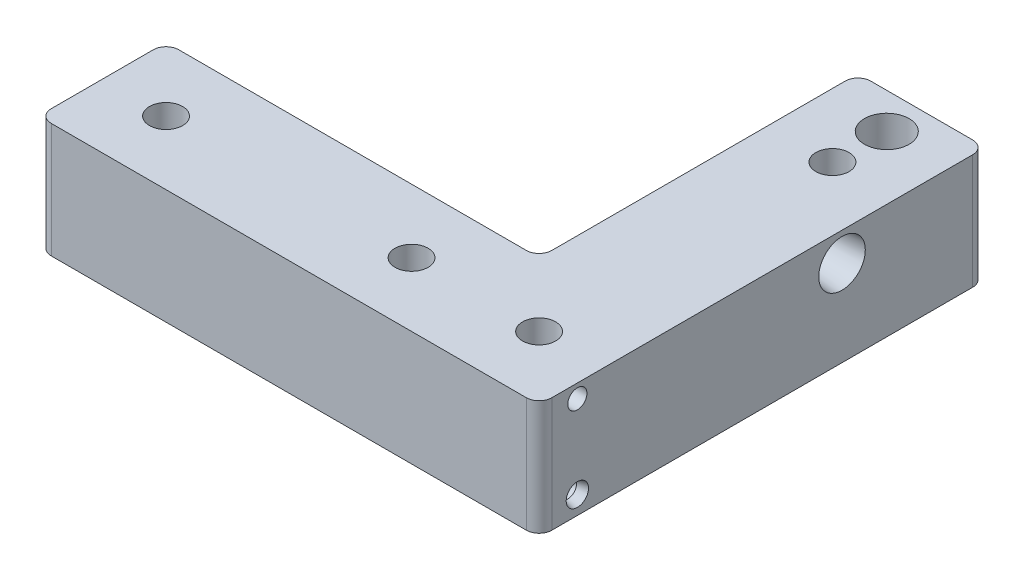
ISO-10303-21;
HEADER;
FILE_DESCRIPTION(('STEP AP214'),'2;1');
FILE_NAME('part.step','',(''),(''),'','','');
FILE_SCHEMA(('AUTOMOTIVE_DESIGN { 1 0 10303 214 1 1 1 1 }'));
ENDSEC;
DATA;
#1=APPLICATION_CONTEXT('core data for automotive mechanical design processes');
#2=APPLICATION_PROTOCOL_DEFINITION('international standard','automotive_design',2000,#1);
#3=PRODUCT_CONTEXT('',#1,'mechanical');
#4=PRODUCT('Part','Part','',(#3));
#5=PRODUCT_RELATED_PRODUCT_CATEGORY('part','',(#4));
#6=PRODUCT_DEFINITION_FORMATION('','',#4);
#7=PRODUCT_DEFINITION_CONTEXT('part definition',#1,'design');
#8=PRODUCT_DEFINITION('design','',#6,#7);
#9=PRODUCT_DEFINITION_SHAPE('','',#8);
#10=(LENGTH_UNIT() NAMED_UNIT(*) SI_UNIT(.MILLI.,.METRE.));
#11=(NAMED_UNIT(*) PLANE_ANGLE_UNIT() SI_UNIT($,.RADIAN.));
#12=(NAMED_UNIT(*) SI_UNIT($,.STERADIAN.) SOLID_ANGLE_UNIT());
#13=UNCERTAINTY_MEASURE_WITH_UNIT(LENGTH_MEASURE(1.E-05),#10,'distance_accuracy_value','');
#14=(GEOMETRIC_REPRESENTATION_CONTEXT(3) GLOBAL_UNCERTAINTY_ASSIGNED_CONTEXT((#13)) GLOBAL_UNIT_ASSIGNED_CONTEXT((#10,
#11,#12)) REPRESENTATION_CONTEXT('',''));
#15=CARTESIAN_POINT('',(0.,0.,0.));
#16=DIRECTION('',(0.,0.,1.));
#17=DIRECTION('',(1.,0.,0.));
#18=AXIS2_PLACEMENT_3D('',#15,#16,#17);
#19=CARTESIAN_POINT('',(150.,-5.14999999999999,-6.00000000000001));
#20=DIRECTION('',(1.,0.,0.));
#21=DIRECTION('',(0.,0.,-1.));
#22=AXIS2_PLACEMENT_3D('',#19,#20,#21);
#23=PLANE('',#22);
#24=CARTESIAN_POINT('',(150.,-5.14999999999999,-6.00000000000001));
#25=DIRECTION('',(1.,0.,0.));
#26=DIRECTION('',(0.,0.,-1.));
#27=AXIS2_PLACEMENT_3D('',#24,#25,#26);
#28=CIRCLE('',#27,1.35);
#29=CARTESIAN_POINT('',(150.,-5.14999999999999,-7.35));
#30=VERTEX_POINT('',#29);
#31=EDGE_CURVE('E19',#30,#30,#28,.T.);
#32=ORIENTED_EDGE('',*,*,#31,.T.);
#33=EDGE_LOOP('',(#32));
#34=FACE_BOUND('',#33,.T.);
#35=ADVANCED_FACE('F16',(#34),#23,.T.);
#36=CARTESIAN_POINT('',(147.10054523,5.,-64.41665231));
#37=DIRECTION('',(0.,1.,0.));
#38=DIRECTION('',(-1.,0.,0.));
#39=AXIS2_PLACEMENT_3D('',#36,#37,#38);
#40=PLANE('',#39);
#41=CARTESIAN_POINT('',(147.10054523,5.,-64.41665231));
#42=DIRECTION('',(0.,1.,0.));
#43=DIRECTION('',(-1.,0.,0.));
#44=AXIS2_PLACEMENT_3D('',#41,#42,#43);
#45=CIRCLE('',#44,3.5);
#46=CARTESIAN_POINT('',(143.60054523,5.,-64.41665231));
#47=VERTEX_POINT('',#46);
#48=EDGE_CURVE('E199',#47,#47,#45,.T.);
#49=ORIENTED_EDGE('',*,*,#48,.T.);
#50=EDGE_LOOP('',(#49));
#51=FACE_BOUND('',#50,.T.);
#52=ADVANCED_FACE('F298',(#51),#40,.T.);
#53=CARTESIAN_POINT('',(150.,-5.14999999999999,-6.00000000000001));
#54=DIRECTION('',(1.,0.,0.));
#55=DIRECTION('',(0.,0.,-1.));
#56=AXIS2_PLACEMENT_3D('',#53,#54,#55);
#57=CYLINDRICAL_SURFACE('',#56,1.35);
#58=CARTESIAN_POINT('',(155.507179676988,-5.14999999999999,-6.00000000000001));
#59=DIRECTION('',(1.,0.,0.));
#60=DIRECTION('',(0.,0.,-1.));
#61=AXIS2_PLACEMENT_3D('',#58,#59,#60);
#62=CIRCLE('',#61,1.34999999997398);
#63=CARTESIAN_POINT('',(155.507179676988,-5.14999999999999,-7.34999999997399));
#64=VERTEX_POINT('',#63);
#65=EDGE_CURVE('E196',#64,#64,#62,.T.);
#66=ORIENTED_EDGE('',*,*,#65,.T.);
#67=EDGE_LOOP('',(#66));
#68=FACE_BOUND('',#67,.T.);
#69=ORIENTED_EDGE('',*,*,#31,.F.);
#70=EDGE_LOOP('',(#69));
#71=FACE_BOUND('',#70,.T.);
#72=ADVANCED_FACE('F295',(#68,#71),#57,.F.);
#73=CARTESIAN_POINT('',(150.,7.84999999999999,-6.00000000000001));
#74=DIRECTION('',(1.,0.,0.));
#75=DIRECTION('',(0.,0.,-1.));
#76=AXIS2_PLACEMENT_3D('',#73,#74,#75);
#77=PLANE('',#76);
#78=CARTESIAN_POINT('',(150.,7.84999999999999,-6.00000000000001));
#79=DIRECTION('',(1.,0.,0.));
#80=DIRECTION('',(0.,0.,-1.));
#81=AXIS2_PLACEMENT_3D('',#78,#79,#80);
#82=CIRCLE('',#81,1.5);
#83=CARTESIAN_POINT('',(150.,7.84999999999999,-7.5));
#84=VERTEX_POINT('',#83);
#85=EDGE_CURVE('E195',#84,#84,#82,.T.);
#86=ORIENTED_EDGE('',*,*,#85,.T.);
#87=EDGE_LOOP('',(#86));
#88=FACE_BOUND('',#87,.T.);
#89=ADVANCED_FACE('F297',(#88),#77,.T.);
#90=CARTESIAN_POINT('',(147.10054523,5.,-64.41665231));
#91=DIRECTION('',(0.,1.,0.));
#92=DIRECTION('',(-1.,0.,0.));
#93=AXIS2_PLACEMENT_3D('',#90,#91,#92);
#94=CYLINDRICAL_SURFACE('',#93,3.5);
#95=ORIENTED_EDGE('',*,*,#48,.F.);
#96=EDGE_LOOP('',(#95));
#97=FACE_BOUND('',#96,.T.);
#98=CARTESIAN_POINT('',(147.10054523,9.99999999999999,-64.41665231));
#99=DIRECTION('',(0.,1.,0.));
#100=DIRECTION('',(-1.,0.,0.));
#101=AXIS2_PLACEMENT_3D('',#98,#99,#100);
#102=CIRCLE('',#101,3.5);
#103=CARTESIAN_POINT('',(143.60054523,9.99999999999999,-64.41665231));
#104=VERTEX_POINT('',#103);
#105=EDGE_CURVE('E194',#104,#104,#102,.F.);
#106=ORIENTED_EDGE('',*,*,#105,.F.);
#107=EDGE_LOOP('',(#106));
#108=FACE_BOUND('',#107,.T.);
#109=ADVANCED_FACE('F306',(#97,#108),#94,.F.);
#110=CARTESIAN_POINT('',(78.5,5.5,-47.5));
#111=DIRECTION('',(1.,0.,0.));
#112=DIRECTION('',(0.,0.,-1.));
#113=AXIS2_PLACEMENT_3D('',#110,#111,#112);
#114=CYLINDRICAL_SURFACE('',#113,2.6);
#115=CARTESIAN_POINT('',(144.999999999982,5.5,-47.5));
#116=DIRECTION('',(1.,0.,0.));
#117=DIRECTION('',(0.,0.,1.));
#118=AXIS2_PLACEMENT_3D('',#115,#116,#117);
#119=CIRCLE('',#118,2.60000000000157);
#120=CARTESIAN_POINT('',(144.999999999982,5.5,-44.8999999999984));
#121=VERTEX_POINT('',#120);
#122=EDGE_CURVE('E191',#121,#121,#119,.T.);
#123=ORIENTED_EDGE('',*,*,#122,.T.);
#124=EDGE_LOOP('',(#123));
#125=FACE_BOUND('',#124,.T.);
#126=CARTESIAN_POINT('',(137.,5.5,-47.5));
#127=DIRECTION('',(1.,0.,0.));
#128=DIRECTION('',(0.,0.,-1.));
#129=AXIS2_PLACEMENT_3D('',#126,#127,#128);
#130=CIRCLE('',#129,2.6);
#131=CARTESIAN_POINT('',(137.,5.5,-50.1));
#132=VERTEX_POINT('',#131);
#133=EDGE_CURVE('E157',#132,#132,#130,.F.);
#134=ORIENTED_EDGE('',*,*,#133,.T.);
#135=EDGE_LOOP('',(#134));
#136=FACE_BOUND('',#135,.T.);
#137=ADVANCED_FACE('F390',(#125,#136),#114,.F.);
#138=CARTESIAN_POINT('',(157.000000000039,-5.14999999999999,-6.00000000000001));
#139=DIRECTION('',(1.,0.,0.));
#140=DIRECTION('',(0.,0.,-1.));
#141=AXIS2_PLACEMENT_3D('',#138,#139,#140);
#142=CONICAL_SURFACE('',#141,1.74999999998726,0.261799387803506);
#143=CARTESIAN_POINT('',(157.000000000039,-5.14999999999999,-6.00000000000001));
#144=DIRECTION('',(1.,0.,0.));
#145=DIRECTION('',(0.,0.,-1.));
#146=AXIS2_PLACEMENT_3D('',#143,#144,#145);
#147=CIRCLE('',#146,1.74999999998726);
#148=CARTESIAN_POINT('',(157.000000000039,-5.14999999999999,-7.74999999998727));
#149=VERTEX_POINT('',#148);
#150=EDGE_CURVE('E248',#149,#149,#147,.T.);
#151=ORIENTED_EDGE('',*,*,#150,.T.);
#152=EDGE_LOOP('',(#151));
#153=FACE_BOUND('',#152,.T.);
#154=ORIENTED_EDGE('',*,*,#65,.F.);
#155=EDGE_LOOP('',(#154));
#156=FACE_BOUND('',#155,.T.);
#157=ADVANCED_FACE('F386',(#153,#156),#142,.F.);
#158=CARTESIAN_POINT('',(150.,7.84999999999999,-6.00000000000001));
#159=DIRECTION('',(1.,0.,0.));
#160=DIRECTION('',(0.,0.,-1.));
#161=AXIS2_PLACEMENT_3D('',#158,#159,#160);
#162=CYLINDRICAL_SURFACE('',#161,1.5);
#163=ORIENTED_EDGE('',*,*,#85,.F.);
#164=EDGE_LOOP('',(#163));
#165=FACE_BOUND('',#164,.T.);
#166=CARTESIAN_POINT('',(157.,7.84999999999999,-6.00000000000001));
#167=DIRECTION('',(1.,0.,0.));
#168=DIRECTION('',(0.,0.,-1.));
#169=AXIS2_PLACEMENT_3D('',#166,#167,#168);
#170=CIRCLE('',#169,1.5);
#171=CARTESIAN_POINT('',(157.,7.84999999999999,-7.5));
#172=VERTEX_POINT('',#171);
#173=EDGE_CURVE('E244',#172,#172,#170,.T.);
#174=ORIENTED_EDGE('',*,*,#173,.T.);
#175=EDGE_LOOP('',(#174));
#176=FACE_BOUND('',#175,.T.);
#177=ADVANCED_FACE('F382',(#165,#176),#162,.F.);
#178=CARTESIAN_POINT('',(156.999999999812,5.5,-47.5));
#179=DIRECTION('',(1.,0.,0.));
#180=DIRECTION('',(0.,0.,-1.));
#181=AXIS2_PLACEMENT_3D('',#178,#179,#180);
#182=CONICAL_SURFACE('',#181,3.64986396229536,0.0872664625994574);
#183=ORIENTED_EDGE('',*,*,#122,.F.);
#184=EDGE_LOOP('',(#183));
#185=FACE_BOUND('',#184,.T.);
#186=CARTESIAN_POINT('',(156.999999999982,5.5,-47.5));
#187=DIRECTION('',(1.,0.,0.));
#188=DIRECTION('',(0.,0.,-1.));
#189=AXIS2_PLACEMENT_3D('',#186,#187,#188);
#190=CIRCLE('',#189,3.64986396231028);
#191=CARTESIAN_POINT('',(156.999999999982,5.5,-51.1498639623102));
#192=VERTEX_POINT('',#191);
#193=EDGE_CURVE('E171',#192,#192,#190,.T.);
#194=ORIENTED_EDGE('',*,*,#193,.T.);
#195=EDGE_LOOP('',(#194));
#196=FACE_BOUND('',#195,.T.);
#197=ADVANCED_FACE('F378',(#185,#196),#182,.F.);
#198=CARTESIAN_POINT('',(157.,9.99999999999999,0.));
#199=DIRECTION('',(0.,1.,0.));
#200=DIRECTION('',(-1.,0.,0.));
#201=AXIS2_PLACEMENT_3D('',#198,#199,#200);
#202=PLANE('',#201);
#203=CARTESIAN_POINT('',(127.,10.,-9.99999999999998));
#204=DIRECTION('',(0.,-1.,0.));
#205=DIRECTION('',(1.,0.,0.));
#206=AXIS2_PLACEMENT_3D('',#203,#204,#205);
#207=CIRCLE('',#206,2.59999999999999);
#208=CARTESIAN_POINT('',(129.6,10.,-9.99999999999998));
#209=VERTEX_POINT('',#208);
#210=EDGE_CURVE('E275',#209,#209,#207,.T.);
#211=ORIENTED_EDGE('',*,*,#210,.T.);
#212=EDGE_LOOP('',(#211));
#213=FACE_BOUND('',#212,.T.);
#214=CARTESIAN_POINT('',(88.5,10.,-9.99999999999995));
#215=DIRECTION('',(0.,-1.,0.));
#216=DIRECTION('',(1.,0.,0.));
#217=AXIS2_PLACEMENT_3D('',#214,#215,#216);
#218=CIRCLE('',#217,2.59999999999999);
#219=CARTESIAN_POINT('',(91.1,10.,-9.99999999999995));
#220=VERTEX_POINT('',#219);
#221=EDGE_CURVE('E271',#220,#220,#218,.T.);
#222=ORIENTED_EDGE('',*,*,#221,.T.);
#223=EDGE_LOOP('',(#222));
#224=FACE_BOUND('',#223,.T.);
#225=DIRECTION('',(-1.,0.,0.));
#226=VECTOR('',#225,1.);
#227=CARTESIAN_POINT('',(157.,9.99999999999999,0.));
#228=LINE('',#227,#226);
#229=CARTESIAN_POINT('',(80.5,9.99999999999999,0.));
#230=VERTEX_POINT('',#229);
#231=CARTESIAN_POINT('',(155.,9.99999999999999,0.));
#232=VERTEX_POINT('',#231);
#233=EDGE_CURVE('E172',#230,#232,#228,.F.);
#234=ORIENTED_EDGE('',*,*,#233,.T.);
#235=CARTESIAN_POINT('',(155.,9.99999999999999,-2.));
#236=DIRECTION('',(0.,-1.,0.));
#237=DIRECTION('',(1.,0.,0.));
#238=AXIS2_PLACEMENT_3D('',#235,#236,#237);
#239=CIRCLE('',#238,2.);
#240=CARTESIAN_POINT('',(157.,9.99999999999999,-2.));
#241=VERTEX_POINT('',#240);
#242=EDGE_CURVE('E175',#241,#232,#239,.T.);
#243=ORIENTED_EDGE('',*,*,#242,.F.);
#244=DIRECTION('',(0.,0.,1.));
#245=VECTOR('',#244,1.);
#246=CARTESIAN_POINT('',(157.,9.99999999999999,-70.));
#247=LINE('',#246,#245);
#248=CARTESIAN_POINT('',(157.,9.99999999999999,-68.));
#249=VERTEX_POINT('',#248);
#250=EDGE_CURVE('E167',#241,#249,#247,.F.);
#251=ORIENTED_EDGE('',*,*,#250,.T.);
#252=CARTESIAN_POINT('',(155.,9.99999999999999,-68.));
#253=DIRECTION('',(0.,-1.,0.));
#254=DIRECTION('',(1.,0.,0.));
#255=AXIS2_PLACEMENT_3D('',#252,#253,#254);
#256=CIRCLE('',#255,2.);
#257=CARTESIAN_POINT('',(155.,9.99999999999999,-70.));
#258=VERTEX_POINT('',#257);
#259=EDGE_CURVE('E146',#258,#249,#256,.T.);
#260=ORIENTED_EDGE('',*,*,#259,.F.);
#261=DIRECTION('',(1.,0.,0.));
#262=VECTOR('',#261,1.);
#263=CARTESIAN_POINT('',(137.,9.99999999999999,-70.));
#264=LINE('',#263,#262);
#265=CARTESIAN_POINT('',(139.,9.99999999999999,-70.));
#266=VERTEX_POINT('',#265);
#267=EDGE_CURVE('E139',#258,#266,#264,.F.);
#268=ORIENTED_EDGE('',*,*,#267,.T.);
#269=CARTESIAN_POINT('',(139.,10.,-68.));
#270=DIRECTION('',(0.,-1.,0.));
#271=DIRECTION('',(1.,0.,0.));
#272=AXIS2_PLACEMENT_3D('',#269,#270,#271);
#273=CIRCLE('',#272,2.);
#274=CARTESIAN_POINT('',(137.,10.,-68.));
#275=VERTEX_POINT('',#274);
#276=EDGE_CURVE('E129',#275,#266,#273,.T.);
#277=ORIENTED_EDGE('',*,*,#276,.F.);
#278=DIRECTION('',(0.,0.,-1.));
#279=VECTOR('',#278,1.);
#280=CARTESIAN_POINT('',(137.,10.,-20.));
#281=LINE('',#280,#279);
#282=CARTESIAN_POINT('',(137.,10.,-22.));
#283=VERTEX_POINT('',#282);
#284=EDGE_CURVE('E124',#275,#283,#281,.F.);
#285=ORIENTED_EDGE('',*,*,#284,.T.);
#286=CARTESIAN_POINT('',(135.,10.,-22.));
#287=DIRECTION('',(0.,1.,0.));
#288=DIRECTION('',(-1.,0.,0.));
#289=AXIS2_PLACEMENT_3D('',#286,#287,#288);
#290=CIRCLE('',#289,2.);
#291=CARTESIAN_POINT('',(135.,10.,-20.));
#292=VERTEX_POINT('',#291);
#293=EDGE_CURVE('E188',#283,#292,#290,.F.);
#294=ORIENTED_EDGE('',*,*,#293,.T.);
#295=DIRECTION('',(1.,0.,0.));
#296=VECTOR('',#295,1.);
#297=CARTESIAN_POINT('',(78.5,10.,-20.));
#298=LINE('',#297,#296);
#299=CARTESIAN_POINT('',(80.5,9.99999999999999,-20.));
#300=VERTEX_POINT('',#299);
#301=EDGE_CURVE('E183',#292,#300,#298,.F.);
#302=ORIENTED_EDGE('',*,*,#301,.T.);
#303=CARTESIAN_POINT('',(80.5,9.99999999999999,-18.));
#304=DIRECTION('',(0.,-1.,0.));
#305=DIRECTION('',(1.,0.,0.));
#306=AXIS2_PLACEMENT_3D('',#303,#304,#305);
#307=CIRCLE('',#306,2.);
#308=CARTESIAN_POINT('',(78.5,9.99999999999999,-18.));
#309=VERTEX_POINT('',#308);
#310=EDGE_CURVE('E257',#309,#300,#307,.T.);
#311=ORIENTED_EDGE('',*,*,#310,.F.);
#312=DIRECTION('',(0.,0.,1.));
#313=VECTOR('',#312,1.);
#314=CARTESIAN_POINT('',(78.5,9.99999999999999,0.));
#315=LINE('',#314,#313);
#316=CARTESIAN_POINT('',(78.5,9.99999999999999,-1.99999999999995));
#317=VERTEX_POINT('',#316);
#318=EDGE_CURVE('E177',#309,#317,#315,.T.);
#319=ORIENTED_EDGE('',*,*,#318,.T.);
#320=CARTESIAN_POINT('',(80.5,9.99999999999999,-1.99999999999995));
#321=DIRECTION('',(0.,-1.,0.));
#322=DIRECTION('',(1.,0.,0.));
#323=AXIS2_PLACEMENT_3D('',#320,#321,#322);
#324=CIRCLE('',#323,2.);
#325=EDGE_CURVE('E181',#230,#317,#324,.T.);
#326=ORIENTED_EDGE('',*,*,#325,.F.);
#327=EDGE_LOOP('',(#234,#243,#251,#260,#268,#277,#285,#294,#302,#311,#319,#326));
#328=FACE_BOUND('',#327,.T.);
#329=CARTESIAN_POINT('',(147.,10.,-56.));
#330=DIRECTION('',(0.,-1.,0.));
#331=DIRECTION('',(1.,0.,0.));
#332=AXIS2_PLACEMENT_3D('',#329,#330,#331);
#333=CIRCLE('',#332,2.6);
#334=CARTESIAN_POINT('',(149.6,10.,-56.));
#335=VERTEX_POINT('',#334);
#336=EDGE_CURVE('E151',#335,#335,#333,.T.);
#337=ORIENTED_EDGE('',*,*,#336,.T.);
#338=EDGE_LOOP('',(#337));
#339=FACE_BOUND('',#338,.T.);
#340=CARTESIAN_POINT('',(147.,10.,-9.99999999999998));
#341=DIRECTION('',(0.,-1.,0.));
#342=DIRECTION('',(1.,0.,0.));
#343=AXIS2_PLACEMENT_3D('',#340,#341,#342);
#344=CIRCLE('',#343,2.6);
#345=CARTESIAN_POINT('',(149.6,10.,-9.99999999999998));
#346=VERTEX_POINT('',#345);
#347=EDGE_CURVE('E267',#346,#346,#344,.T.);
#348=ORIENTED_EDGE('',*,*,#347,.T.);
#349=EDGE_LOOP('',(#348));
#350=FACE_BOUND('',#349,.T.);
#351=ORIENTED_EDGE('',*,*,#105,.T.);
#352=EDGE_LOOP('',(#351));
#353=FACE_BOUND('',#352,.T.);
#354=ADVANCED_FACE('F143',(#213,#224,#328,#339,#350,#353),#202,.T.);
#355=CARTESIAN_POINT('',(127.,10.,-9.99999999999998));
#356=DIRECTION('',(0.,-1.,0.));
#357=DIRECTION('',(1.,0.,0.));
#358=AXIS2_PLACEMENT_3D('',#355,#356,#357);
#359=CYLINDRICAL_SURFACE('',#358,2.59999999999999);
#360=CARTESIAN_POINT('',(127.,-7.99999999999999,-9.99999999999998));
#361=DIRECTION('',(0.,-1.,0.));
#362=DIRECTION('',(1.,0.,0.));
#363=AXIS2_PLACEMENT_3D('',#360,#361,#362);
#364=CIRCLE('',#363,2.59999999999999);
#365=CARTESIAN_POINT('',(129.6,-7.99999999999999,-9.99999999999998));
#366=VERTEX_POINT('',#365);
#367=EDGE_CURVE('E236',#366,#366,#364,.T.);
#368=ORIENTED_EDGE('',*,*,#367,.T.);
#369=EDGE_LOOP('',(#368));
#370=FACE_BOUND('',#369,.T.);
#371=ORIENTED_EDGE('',*,*,#210,.F.);
#372=EDGE_LOOP('',(#371));
#373=FACE_BOUND('',#372,.T.);
#374=ADVANCED_FACE('F371',(#370,#373),#359,.F.);
#375=CARTESIAN_POINT('',(88.5,10.,-9.99999999999995));
#376=DIRECTION('',(0.,-1.,0.));
#377=DIRECTION('',(1.,0.,0.));
#378=AXIS2_PLACEMENT_3D('',#375,#376,#377);
#379=CYLINDRICAL_SURFACE('',#378,2.59999999999999);
#380=CARTESIAN_POINT('',(88.5,-7.99999999999999,-9.99999999999995));
#381=DIRECTION('',(0.,-1.,0.));
#382=DIRECTION('',(1.,0.,0.));
#383=AXIS2_PLACEMENT_3D('',#380,#381,#382);
#384=CIRCLE('',#383,2.59999999999999);
#385=CARTESIAN_POINT('',(91.1,-7.99999999999999,-9.99999999999995));
#386=VERTEX_POINT('',#385);
#387=EDGE_CURVE('E232',#386,#386,#384,.T.);
#388=ORIENTED_EDGE('',*,*,#387,.T.);
#389=EDGE_LOOP('',(#388));
#390=FACE_BOUND('',#389,.T.);
#391=ORIENTED_EDGE('',*,*,#221,.F.);
#392=EDGE_LOOP('',(#391));
#393=FACE_BOUND('',#392,.T.);
#394=ADVANCED_FACE('F367',(#390,#393),#379,.F.);
#395=CARTESIAN_POINT('',(147.,10.,-9.99999999999998));
#396=DIRECTION('',(0.,-1.,0.));
#397=DIRECTION('',(1.,0.,0.));
#398=AXIS2_PLACEMENT_3D('',#395,#396,#397);
#399=CYLINDRICAL_SURFACE('',#398,2.6);
#400=CARTESIAN_POINT('',(147.,-7.99999999999999,-9.99999999999998));
#401=DIRECTION('',(0.,-1.,0.));
#402=DIRECTION('',(1.,0.,0.));
#403=AXIS2_PLACEMENT_3D('',#400,#401,#402);
#404=CIRCLE('',#403,2.6);
#405=CARTESIAN_POINT('',(149.6,-7.99999999999999,-9.99999999999998));
#406=VERTEX_POINT('',#405);
#407=EDGE_CURVE('E228',#406,#406,#404,.T.);
#408=ORIENTED_EDGE('',*,*,#407,.T.);
#409=EDGE_LOOP('',(#408));
#410=FACE_BOUND('',#409,.T.);
#411=ORIENTED_EDGE('',*,*,#347,.F.);
#412=EDGE_LOOP('',(#411));
#413=FACE_BOUND('',#412,.T.);
#414=ADVANCED_FACE('F363',(#410,#413),#399,.F.);
#415=CARTESIAN_POINT('',(147.,10.,-56.));
#416=DIRECTION('',(0.,-1.,0.));
#417=DIRECTION('',(1.,0.,0.));
#418=AXIS2_PLACEMENT_3D('',#415,#416,#417);
#419=CYLINDRICAL_SURFACE('',#418,2.6);
#420=CARTESIAN_POINT('',(147.,-7.99999999999999,-56.));
#421=DIRECTION('',(0.,-1.,0.));
#422=DIRECTION('',(1.,0.,0.));
#423=AXIS2_PLACEMENT_3D('',#420,#421,#422);
#424=CIRCLE('',#423,2.6);
#425=CARTESIAN_POINT('',(149.6,-7.99999999999999,-56.));
#426=VERTEX_POINT('',#425);
#427=EDGE_CURVE('E224',#426,#426,#424,.T.);
#428=ORIENTED_EDGE('',*,*,#427,.T.);
#429=EDGE_LOOP('',(#428));
#430=FACE_BOUND('',#429,.T.);
#431=ORIENTED_EDGE('',*,*,#336,.F.);
#432=EDGE_LOOP('',(#431));
#433=FACE_BOUND('',#432,.T.);
#434=ADVANCED_FACE('F360',(#430,#433),#419,.F.);
#435=CARTESIAN_POINT('',(137.,10.,-70.));
#436=DIRECTION('',(0.,0.,1.));
#437=DIRECTION('',(1.,0.,0.));
#438=AXIS2_PLACEMENT_3D('',#435,#436,#437);
#439=PLANE('',#438);
#440=DIRECTION('',(-1.,0.,0.));
#441=VECTOR('',#440,1.);
#442=CARTESIAN_POINT('',(155.,-7.99999999999999,-70.));
#443=LINE('',#442,#441);
#444=CARTESIAN_POINT('',(155.,-7.99999999999999,-70.));
#445=VERTEX_POINT('',#444);
#446=CARTESIAN_POINT('',(139.,-7.99999999999999,-70.));
#447=VERTEX_POINT('',#446);
#448=EDGE_CURVE('E155',#445,#447,#443,.T.);
#449=ORIENTED_EDGE('',*,*,#448,.T.);
#450=DIRECTION('',(0.,-1.,0.));
#451=VECTOR('',#450,1.);
#452=CARTESIAN_POINT('',(139.,10.,-70.));
#453=LINE('',#452,#451);
#454=EDGE_CURVE('E134',#266,#447,#453,.T.);
#455=ORIENTED_EDGE('',*,*,#454,.F.);
#456=ORIENTED_EDGE('',*,*,#267,.F.);
#457=DIRECTION('',(0.,-1.,0.));
#458=VECTOR('',#457,1.);
#459=CARTESIAN_POINT('',(155.,9.99999999999999,-70.));
#460=LINE('',#459,#458);
#461=EDGE_CURVE('E240',#445,#258,#460,.F.);
#462=ORIENTED_EDGE('',*,*,#461,.F.);
#463=EDGE_LOOP('',(#449,#455,#456,#462));
#464=FACE_BOUND('',#463,.T.);
#465=ADVANCED_FACE('F154',(#464),#439,.F.);
#466=CARTESIAN_POINT('',(139.,10.,-68.));
#467=DIRECTION('',(0.,-1.,0.));
#468=DIRECTION('',(1.,0.,0.));
#469=AXIS2_PLACEMENT_3D('',#466,#467,#468);
#470=CYLINDRICAL_SURFACE('',#469,2.);
#471=CARTESIAN_POINT('',(139.,-7.99999999999999,-68.));
#472=DIRECTION('',(0.,-1.,0.));
#473=DIRECTION('',(1.,0.,0.));
#474=AXIS2_PLACEMENT_3D('',#471,#472,#473);
#475=CIRCLE('',#474,2.);
#476=CARTESIAN_POINT('',(137.,-7.99999999999999,-68.));
#477=VERTEX_POINT('',#476);
#478=EDGE_CURVE('E221',#447,#477,#475,.F.);
#479=ORIENTED_EDGE('',*,*,#478,.T.);
#480=DIRECTION('',(0.,1.,0.));
#481=VECTOR('',#480,1.);
#482=CARTESIAN_POINT('',(137.,10.,-68.));
#483=LINE('',#482,#481);
#484=EDGE_CURVE('E136',#477,#275,#483,.T.);
#485=ORIENTED_EDGE('',*,*,#484,.T.);
#486=ORIENTED_EDGE('',*,*,#276,.T.);
#487=ORIENTED_EDGE('',*,*,#454,.T.);
#488=EDGE_LOOP('',(#479,#485,#486,#487));
#489=FACE_BOUND('',#488,.T.);
#490=ADVANCED_FACE('F132',(#489),#470,.T.);
#491=CARTESIAN_POINT('',(137.,10.,-20.));
#492=DIRECTION('',(1.,0.,0.));
#493=DIRECTION('',(0.,0.,-1.));
#494=AXIS2_PLACEMENT_3D('',#491,#492,#493);
#495=PLANE('',#494);
#496=DIRECTION('',(0.,0.,1.));
#497=VECTOR('',#496,1.);
#498=CARTESIAN_POINT('',(137.,-7.99999999999999,-68.));
#499=LINE('',#498,#497);
#500=CARTESIAN_POINT('',(137.,-7.99999999999999,-22.));
#501=VERTEX_POINT('',#500);
#502=EDGE_CURVE('E220',#477,#501,#499,.T.);
#503=ORIENTED_EDGE('',*,*,#502,.T.);
#504=DIRECTION('',(0.,1.,0.));
#505=VECTOR('',#504,1.);
#506=CARTESIAN_POINT('',(137.,10.,-22.));
#507=LINE('',#506,#505);
#508=EDGE_CURVE('E263',#501,#283,#507,.T.);
#509=ORIENTED_EDGE('',*,*,#508,.T.);
#510=ORIENTED_EDGE('',*,*,#284,.F.);
#511=ORIENTED_EDGE('',*,*,#484,.F.);
#512=EDGE_LOOP('',(#503,#509,#510,#511));
#513=FACE_BOUND('',#512,.T.);
#514=ORIENTED_EDGE('',*,*,#133,.F.);
#515=EDGE_LOOP('',(#514));
#516=FACE_BOUND('',#515,.T.);
#517=ADVANCED_FACE('F352',(#513,#516),#495,.F.);
#518=CARTESIAN_POINT('',(135.,10.,-22.));
#519=DIRECTION('',(0.,1.,0.));
#520=DIRECTION('',(-1.,0.,0.));
#521=AXIS2_PLACEMENT_3D('',#518,#519,#520);
#522=CYLINDRICAL_SURFACE('',#521,2.);
#523=ORIENTED_EDGE('',*,*,#508,.F.);
#524=CARTESIAN_POINT('',(135.,-7.99999999999999,-22.));
#525=DIRECTION('',(0.,1.,0.));
#526=DIRECTION('',(-1.,0.,0.));
#527=AXIS2_PLACEMENT_3D('',#524,#525,#526);
#528=CIRCLE('',#527,2.);
#529=CARTESIAN_POINT('',(135.,-7.99999999999999,-20.));
#530=VERTEX_POINT('',#529);
#531=EDGE_CURVE('E216',#501,#530,#528,.F.);
#532=ORIENTED_EDGE('',*,*,#531,.T.);
#533=DIRECTION('',(0.,1.,0.));
#534=VECTOR('',#533,1.);
#535=CARTESIAN_POINT('',(135.,9.99999999999999,-20.));
#536=LINE('',#535,#534);
#537=EDGE_CURVE('E187',#530,#292,#536,.T.);
#538=ORIENTED_EDGE('',*,*,#537,.T.);
#539=ORIENTED_EDGE('',*,*,#293,.F.);
#540=EDGE_LOOP('',(#523,#532,#538,#539));
#541=FACE_BOUND('',#540,.T.);
#542=ADVANCED_FACE('F348',(#541),#522,.F.);
#543=CARTESIAN_POINT('',(78.5,9.99999999999999,-20.));
#544=DIRECTION('',(0.,0.,1.));
#545=DIRECTION('',(1.,0.,0.));
#546=AXIS2_PLACEMENT_3D('',#543,#544,#545);
#547=PLANE('',#546);
#548=DIRECTION('',(-1.,0.,0.));
#549=VECTOR('',#548,1.);
#550=CARTESIAN_POINT('',(155.,-7.99999999999999,-20.));
#551=LINE('',#550,#549);
#552=CARTESIAN_POINT('',(80.5,-7.99999999999999,-20.));
#553=VERTEX_POINT('',#552);
#554=EDGE_CURVE('E215',#530,#553,#551,.T.);
#555=ORIENTED_EDGE('',*,*,#554,.T.);
#556=DIRECTION('',(0.,-1.,0.));
#557=VECTOR('',#556,1.);
#558=CARTESIAN_POINT('',(80.5,9.99999999999999,-20.));
#559=LINE('',#558,#557);
#560=EDGE_CURVE('E260',#300,#553,#559,.T.);
#561=ORIENTED_EDGE('',*,*,#560,.F.);
#562=ORIENTED_EDGE('',*,*,#301,.F.);
#563=ORIENTED_EDGE('',*,*,#537,.F.);
#564=EDGE_LOOP('',(#555,#561,#562,#563));
#565=FACE_BOUND('',#564,.T.);
#566=ADVANCED_FACE('F344',(#565),#547,.F.);
#567=CARTESIAN_POINT('',(80.5,9.99999999999999,-18.));
#568=DIRECTION('',(0.,-1.,0.));
#569=DIRECTION('',(1.,0.,0.));
#570=AXIS2_PLACEMENT_3D('',#567,#568,#569);
#571=CYLINDRICAL_SURFACE('',#570,2.);
#572=CARTESIAN_POINT('',(80.5,-7.99999999999999,-18.));
#573=DIRECTION('',(0.,-1.,0.));
#574=DIRECTION('',(1.,0.,0.));
#575=AXIS2_PLACEMENT_3D('',#572,#573,#574);
#576=CIRCLE('',#575,2.);
#577=CARTESIAN_POINT('',(78.5,-7.99999999999999,-18.));
#578=VERTEX_POINT('',#577);
#579=EDGE_CURVE('E211',#553,#578,#576,.F.);
#580=ORIENTED_EDGE('',*,*,#579,.T.);
#581=DIRECTION('',(0.,1.,0.));
#582=VECTOR('',#581,1.);
#583=CARTESIAN_POINT('',(78.5,9.99999999999999,-18.));
#584=LINE('',#583,#582);
#585=EDGE_CURVE('E182',#578,#309,#584,.T.);
#586=ORIENTED_EDGE('',*,*,#585,.T.);
#587=ORIENTED_EDGE('',*,*,#310,.T.);
#588=ORIENTED_EDGE('',*,*,#560,.T.);
#589=EDGE_LOOP('',(#580,#586,#587,#588));
#590=FACE_BOUND('',#589,.T.);
#591=ADVANCED_FACE('F340',(#590),#571,.T.);
#592=CARTESIAN_POINT('',(78.5,9.99999999999999,0.));
#593=DIRECTION('',(1.,0.,0.));
#594=DIRECTION('',(0.,1.,0.));
#595=AXIS2_PLACEMENT_3D('',#592,#593,#594);
#596=PLANE('',#595);
#597=ORIENTED_EDGE('',*,*,#585,.F.);
#598=DIRECTION('',(0.,0.,1.));
#599=VECTOR('',#598,1.);
#600=CARTESIAN_POINT('',(78.5,-7.99999999999999,-68.));
#601=LINE('',#600,#599);
#602=CARTESIAN_POINT('',(78.5,-7.99999999999999,-1.99999999999995));
#603=VERTEX_POINT('',#602);
#604=EDGE_CURVE('E210',#578,#603,#601,.T.);
#605=ORIENTED_EDGE('',*,*,#604,.T.);
#606=DIRECTION('',(0.,-1.,0.));
#607=VECTOR('',#606,1.);
#608=CARTESIAN_POINT('',(78.5,9.99999999999999,-1.99999999999995));
#609=LINE('',#608,#607);
#610=EDGE_CURVE('E256',#317,#603,#609,.T.);
#611=ORIENTED_EDGE('',*,*,#610,.F.);
#612=ORIENTED_EDGE('',*,*,#318,.F.);
#613=EDGE_LOOP('',(#597,#605,#611,#612));
#614=FACE_BOUND('',#613,.T.);
#615=ADVANCED_FACE('F337',(#614),#596,.F.);
#616=CARTESIAN_POINT('',(80.5,9.99999999999999,-1.99999999999995));
#617=DIRECTION('',(0.,-1.,0.));
#618=DIRECTION('',(1.,0.,0.));
#619=AXIS2_PLACEMENT_3D('',#616,#617,#618);
#620=CYLINDRICAL_SURFACE('',#619,2.);
#621=CARTESIAN_POINT('',(80.5,-7.99999999999999,-1.99999999999995));
#622=DIRECTION('',(0.,-1.,0.));
#623=DIRECTION('',(1.,0.,0.));
#624=AXIS2_PLACEMENT_3D('',#621,#622,#623);
#625=CIRCLE('',#624,2.);
#626=CARTESIAN_POINT('',(80.5,-7.99999999999999,0.));
#627=VERTEX_POINT('',#626);
#628=EDGE_CURVE('E206',#603,#627,#625,.F.);
#629=ORIENTED_EDGE('',*,*,#628,.T.);
#630=DIRECTION('',(0.,1.,0.));
#631=VECTOR('',#630,1.);
#632=CARTESIAN_POINT('',(80.5,9.99999999999999,0.));
#633=LINE('',#632,#631);
#634=EDGE_CURVE('E176',#627,#230,#633,.T.);
#635=ORIENTED_EDGE('',*,*,#634,.T.);
#636=ORIENTED_EDGE('',*,*,#325,.T.);
#637=ORIENTED_EDGE('',*,*,#610,.T.);
#638=EDGE_LOOP('',(#629,#635,#636,#637));
#639=FACE_BOUND('',#638,.T.);
#640=ADVANCED_FACE('F333',(#639),#620,.T.);
#641=CARTESIAN_POINT('',(157.,9.99999999999999,0.));
#642=DIRECTION('',(0.,0.,-1.));
#643=DIRECTION('',(-1.,0.,0.));
#644=AXIS2_PLACEMENT_3D('',#641,#642,#643);
#645=PLANE('',#644);
#646=ORIENTED_EDGE('',*,*,#634,.F.);
#647=DIRECTION('',(-1.,0.,0.));
#648=VECTOR('',#647,1.);
#649=CARTESIAN_POINT('',(155.,-7.99999999999999,0.));
#650=LINE('',#649,#648);
#651=CARTESIAN_POINT('',(155.,-7.99999999999999,0.));
#652=VERTEX_POINT('',#651);
#653=EDGE_CURVE('E205',#627,#652,#650,.F.);
#654=ORIENTED_EDGE('',*,*,#653,.T.);
#655=DIRECTION('',(0.,-1.,0.));
#656=VECTOR('',#655,1.);
#657=CARTESIAN_POINT('',(155.,9.99999999999999,0.));
#658=LINE('',#657,#656);
#659=EDGE_CURVE('E252',#232,#652,#658,.T.);
#660=ORIENTED_EDGE('',*,*,#659,.F.);
#661=ORIENTED_EDGE('',*,*,#233,.F.);
#662=EDGE_LOOP('',(#646,#654,#660,#661));
#663=FACE_BOUND('',#662,.T.);
#664=ADVANCED_FACE('F330',(#663),#645,.F.);
#665=CARTESIAN_POINT('',(155.,9.99999999999999,-2.));
#666=DIRECTION('',(0.,-1.,0.));
#667=DIRECTION('',(1.,0.,0.));
#668=AXIS2_PLACEMENT_3D('',#665,#666,#667);
#669=CYLINDRICAL_SURFACE('',#668,2.);
#670=CARTESIAN_POINT('',(155.,-7.99999999999999,-2.));
#671=DIRECTION('',(0.,-1.,0.));
#672=DIRECTION('',(1.,0.,0.));
#673=AXIS2_PLACEMENT_3D('',#670,#671,#672);
#674=CIRCLE('',#673,2.);
#675=CARTESIAN_POINT('',(157.,-7.99999999999999,-2.));
#676=VERTEX_POINT('',#675);
#677=EDGE_CURVE('E201',#652,#676,#674,.F.);
#678=ORIENTED_EDGE('',*,*,#677,.T.);
#679=DIRECTION('',(0.,1.,0.));
#680=VECTOR('',#679,1.);
#681=CARTESIAN_POINT('',(157.,9.99999999999999,-2.));
#682=LINE('',#681,#680);
#683=EDGE_CURVE('E170',#676,#241,#682,.T.);
#684=ORIENTED_EDGE('',*,*,#683,.T.);
#685=ORIENTED_EDGE('',*,*,#242,.T.);
#686=ORIENTED_EDGE('',*,*,#659,.T.);
#687=EDGE_LOOP('',(#678,#684,#685,#686));
#688=FACE_BOUND('',#687,.T.);
#689=ADVANCED_FACE('F326',(#688),#669,.T.);
#690=CARTESIAN_POINT('',(157.,9.99999999999999,-70.));
#691=DIRECTION('',(-1.,0.,0.));
#692=DIRECTION('',(0.,0.,1.));
#693=AXIS2_PLACEMENT_3D('',#690,#691,#692);
#694=PLANE('',#693);
#695=DIRECTION('',(0.,0.,1.));
#696=VECTOR('',#695,1.);
#697=CARTESIAN_POINT('',(157.,-7.99999999999999,-68.));
#698=LINE('',#697,#696);
#699=CARTESIAN_POINT('',(157.,-7.99999999999999,-68.));
#700=VERTEX_POINT('',#699);
#701=EDGE_CURVE('E26',#676,#700,#698,.F.);
#702=ORIENTED_EDGE('',*,*,#701,.T.);
#703=DIRECTION('',(0.,-1.,0.));
#704=VECTOR('',#703,1.);
#705=CARTESIAN_POINT('',(157.,9.99999999999999,-68.));
#706=LINE('',#705,#704);
#707=EDGE_CURVE('E38',#249,#700,#706,.T.);
#708=ORIENTED_EDGE('',*,*,#707,.F.);
#709=ORIENTED_EDGE('',*,*,#250,.F.);
#710=ORIENTED_EDGE('',*,*,#683,.F.);
#711=EDGE_LOOP('',(#702,#708,#709,#710));
#712=FACE_BOUND('',#711,.T.);
#713=ORIENTED_EDGE('',*,*,#193,.F.);
#714=EDGE_LOOP('',(#713));
#715=FACE_BOUND('',#714,.T.);
#716=ORIENTED_EDGE('',*,*,#173,.F.);
#717=EDGE_LOOP('',(#716));
#718=FACE_BOUND('',#717,.T.);
#719=ORIENTED_EDGE('',*,*,#150,.F.);
#720=EDGE_LOOP('',(#719));
#721=FACE_BOUND('',#720,.T.);
#722=ADVANCED_FACE('F319',(#712,#715,#718,#721),#694,.F.);
#723=CARTESIAN_POINT('',(155.,9.99999999999999,-68.));
#724=DIRECTION('',(0.,-1.,0.));
#725=DIRECTION('',(1.,0.,0.));
#726=AXIS2_PLACEMENT_3D('',#723,#724,#725);
#727=CYLINDRICAL_SURFACE('',#726,2.);
#728=CARTESIAN_POINT('',(155.,-7.99999999999999,-68.));
#729=DIRECTION('',(0.,-1.,0.));
#730=DIRECTION('',(1.,0.,0.));
#731=AXIS2_PLACEMENT_3D('',#728,#729,#730);
#732=CIRCLE('',#731,2.);
#733=EDGE_CURVE('E11',#700,#445,#732,.F.);
#734=ORIENTED_EDGE('',*,*,#733,.T.);
#735=ORIENTED_EDGE('',*,*,#461,.T.);
#736=ORIENTED_EDGE('',*,*,#259,.T.);
#737=ORIENTED_EDGE('',*,*,#707,.T.);
#738=EDGE_LOOP('',(#734,#735,#736,#737));
#739=FACE_BOUND('',#738,.T.);
#740=ADVANCED_FACE('F311',(#739),#727,.T.);
#741=CARTESIAN_POINT('',(155.,-7.99999999999999,-68.));
#742=DIRECTION('',(0.,1.,0.));
#743=DIRECTION('',(-1.,0.,0.));
#744=AXIS2_PLACEMENT_3D('',#741,#742,#743);
#745=PLANE('',#744);
#746=ORIENTED_EDGE('',*,*,#701,.F.);
#747=ORIENTED_EDGE('',*,*,#677,.F.);
#748=ORIENTED_EDGE('',*,*,#653,.F.);
#749=ORIENTED_EDGE('',*,*,#628,.F.);
#750=ORIENTED_EDGE('',*,*,#604,.F.);
#751=ORIENTED_EDGE('',*,*,#579,.F.);
#752=ORIENTED_EDGE('',*,*,#554,.F.);
#753=ORIENTED_EDGE('',*,*,#531,.F.);
#754=ORIENTED_EDGE('',*,*,#502,.F.);
#755=ORIENTED_EDGE('',*,*,#478,.F.);
#756=ORIENTED_EDGE('',*,*,#448,.F.);
#757=ORIENTED_EDGE('',*,*,#733,.F.);
#758=EDGE_LOOP('',(#746,#747,#748,#749,#750,#751,#752,#753,#754,#755,#756,#757));
#759=FACE_BOUND('',#758,.T.);
#760=ORIENTED_EDGE('',*,*,#427,.F.);
#761=EDGE_LOOP('',(#760));
#762=FACE_BOUND('',#761,.T.);
#763=ORIENTED_EDGE('',*,*,#407,.F.);
#764=EDGE_LOOP('',(#763));
#765=FACE_BOUND('',#764,.T.);
#766=ORIENTED_EDGE('',*,*,#387,.F.);
#767=EDGE_LOOP('',(#766));
#768=FACE_BOUND('',#767,.T.);
#769=ORIENTED_EDGE('',*,*,#367,.F.);
#770=EDGE_LOOP('',(#769));
#771=FACE_BOUND('',#770,.T.);
#772=ADVANCED_FACE('F309',(#759,#762,#765,#768,#771),#745,.F.);
#773=CLOSED_SHELL('',(#35,#52,#72,#89,#109,#137,#157,#177,#197,#354,#374,#394,#414,#434,#465,
#490,#517,#542,#566,#591,#615,#640,#664,#689,#722,#740,#772));
#774=MANIFOLD_SOLID_BREP('B1',#773);
#775=ADVANCED_BREP_SHAPE_REPRESENTATION('',(#18,#774),#14);
#776=SHAPE_DEFINITION_REPRESENTATION(#9,#775);
ENDSEC;
END-ISO-10303-21;
